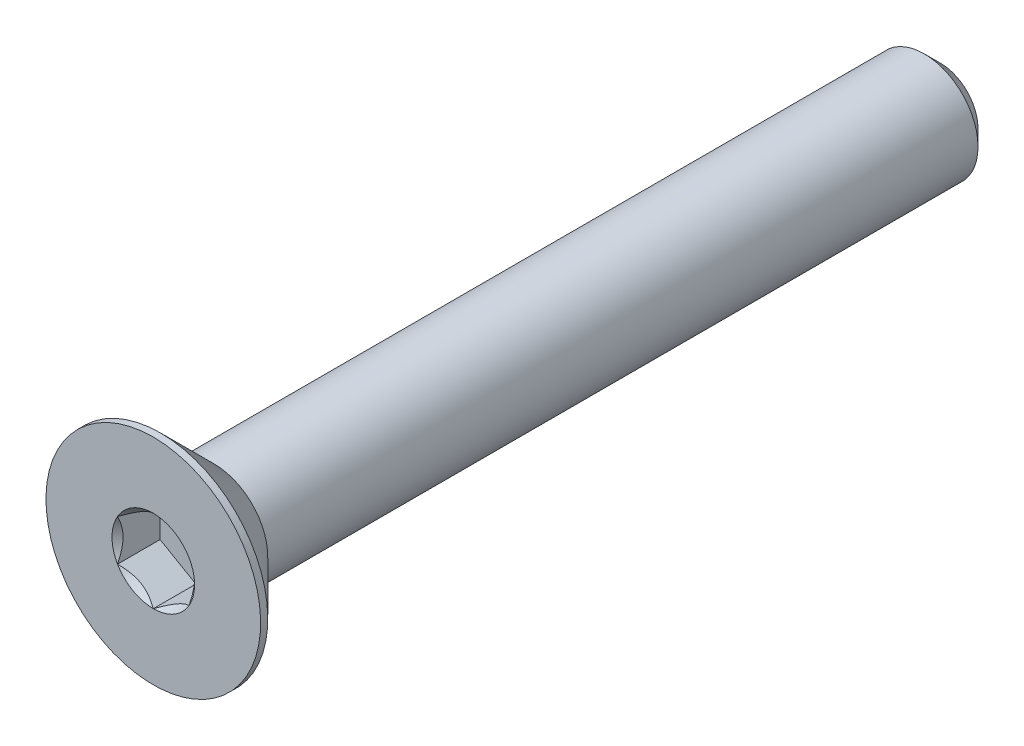
ISO-10303-21;
HEADER;
FILE_DESCRIPTION(('STEP AP214'),'2;1');
FILE_NAME('part.step','',(''),(''),'','','');
FILE_SCHEMA(('AUTOMOTIVE_DESIGN { 1 0 10303 214 1 1 1 1 }'));
ENDSEC;
DATA;
#1=APPLICATION_CONTEXT('core data for automotive mechanical design processes');
#2=APPLICATION_PROTOCOL_DEFINITION('international standard','automotive_design',2000,#1);
#3=PRODUCT_CONTEXT('',#1,'mechanical');
#4=PRODUCT('Part','Part','',(#3));
#5=PRODUCT_RELATED_PRODUCT_CATEGORY('part','',(#4));
#6=PRODUCT_DEFINITION_FORMATION('','',#4);
#7=PRODUCT_DEFINITION_CONTEXT('part definition',#1,'design');
#8=PRODUCT_DEFINITION('design','',#6,#7);
#9=PRODUCT_DEFINITION_SHAPE('','',#8);
#10=(LENGTH_UNIT() NAMED_UNIT(*) SI_UNIT(.MILLI.,.METRE.));
#11=(NAMED_UNIT(*) PLANE_ANGLE_UNIT() SI_UNIT($,.RADIAN.));
#12=(NAMED_UNIT(*) SI_UNIT($,.STERADIAN.) SOLID_ANGLE_UNIT());
#13=UNCERTAINTY_MEASURE_WITH_UNIT(LENGTH_MEASURE(1.E-05),#10,'distance_accuracy_value','');
#14=(GEOMETRIC_REPRESENTATION_CONTEXT(3) GLOBAL_UNCERTAINTY_ASSIGNED_CONTEXT((#13)) GLOBAL_UNIT_ASSIGNED_CONTEXT((#10,
#11,#12)) REPRESENTATION_CONTEXT('',''));
#15=CARTESIAN_POINT('',(0.,0.,0.));
#16=DIRECTION('',(0.,0.,1.));
#17=DIRECTION('',(1.,0.,0.));
#18=AXIS2_PLACEMENT_3D('',#15,#16,#17);
#19=CARTESIAN_POINT('',(0.,0.,-11.));
#20=DIRECTION('',(0.,0.,-1.));
#21=DIRECTION('',(0.,1.,0.));
#22=AXIS2_PLACEMENT_3D('',#19,#20,#21);
#23=CYLINDRICAL_SURFACE('',#22,1.5);
#24=CARTESIAN_POINT('',(0.,0.,9.3));
#25=DIRECTION('',(0.,0.,-1.));
#26=DIRECTION('',(0.,1.,0.));
#27=AXIS2_PLACEMENT_3D('',#24,#25,#26);
#28=CIRCLE('',#27,1.5);
#29=CARTESIAN_POINT('',(0.,1.5,9.3));
#30=VERTEX_POINT('',#29);
#31=EDGE_CURVE('E11',#30,#30,#28,.F.);
#32=ORIENTED_EDGE('',*,*,#31,.F.);
#33=EDGE_LOOP('',(#32));
#34=FACE_BOUND('',#33,.T.);
#35=CARTESIAN_POINT('',(0.,0.,-10.55));
#36=DIRECTION('',(0.,0.,-1.));
#37=DIRECTION('',(0.,1.,0.));
#38=AXIS2_PLACEMENT_3D('',#35,#36,#37);
#39=CIRCLE('',#38,1.5);
#40=CARTESIAN_POINT('',(0.,-1.5,-10.55));
#41=VERTEX_POINT('',#40);
#42=EDGE_CURVE('E47',#41,#41,#39,.F.);
#43=ORIENTED_EDGE('',*,*,#42,.T.);
#44=EDGE_LOOP('',(#43));
#45=FACE_BOUND('',#44,.T.);
#46=ADVANCED_FACE('F39',(#34,#45),#23,.T.);
#47=CARTESIAN_POINT('',(0.,1.5,-11.));
#48=DIRECTION('',(0.,0.,-1.));
#49=DIRECTION('',(0.,1.,0.));
#50=AXIS2_PLACEMENT_3D('',#47,#48,#49);
#51=PLANE('',#50);
#52=CARTESIAN_POINT('',(0.,0.,-11.));
#53=DIRECTION('',(0.,0.,-1.));
#54=DIRECTION('',(0.,1.,0.));
#55=AXIS2_PLACEMENT_3D('',#52,#53,#54);
#56=CIRCLE('',#55,1.04999999999999);
#57=CARTESIAN_POINT('',(0.,-1.04999999999999,-11.));
#58=VERTEX_POINT('',#57);
#59=EDGE_CURVE('E151',#58,#58,#56,.T.);
#60=ORIENTED_EDGE('',*,*,#59,.T.);
#61=EDGE_LOOP('',(#60));
#62=FACE_BOUND('',#61,.T.);
#63=ADVANCED_FACE('F160',(#62),#51,.T.);
#64=CARTESIAN_POINT('',(0.,0.,-11.));
#65=DIRECTION('',(0.,0.,1.));
#66=DIRECTION('',(0.,-1.,0.));
#67=AXIS2_PLACEMENT_3D('',#64,#65,#66);
#68=CONICAL_SURFACE('',#67,1.04999999999999,0.78539816339745);
#69=CARTESIAN_POINT('',(0.,-1.5,-10.55));
#70=CARTESIAN_POINT('',(0.,-1.4953125,-10.5546875));
#71=CARTESIAN_POINT('',(0.,-1.490625,-10.559375));
#72=CARTESIAN_POINT('',(0.,-1.48125,-10.56875));
#73=CARTESIAN_POINT('',(0.,-1.4765625,-10.5734375));
#74=CARTESIAN_POINT('',(0.,-1.4671875,-10.5828125));
#75=CARTESIAN_POINT('',(0.,-1.4625,-10.5875));
#76=CARTESIAN_POINT('',(0.,-1.453125,-10.596875));
#77=CARTESIAN_POINT('',(0.,-1.4484375,-10.6015625));
#78=CARTESIAN_POINT('',(0.,-1.4390625,-10.6109375));
#79=CARTESIAN_POINT('',(0.,-1.434375,-10.615625));
#80=CARTESIAN_POINT('',(0.,-1.425,-10.625));
#81=CARTESIAN_POINT('',(0.,-1.4203125,-10.6296875));
#82=CARTESIAN_POINT('',(0.,-1.4109375,-10.6390625));
#83=CARTESIAN_POINT('',(0.,-1.40625,-10.64375));
#84=CARTESIAN_POINT('',(0.,-1.396875,-10.653125));
#85=CARTESIAN_POINT('',(0.,-1.3921875,-10.6578125));
#86=CARTESIAN_POINT('',(0.,-1.38281249999999,-10.6671875));
#87=CARTESIAN_POINT('',(0.,-1.37812499999999,-10.671875));
#88=CARTESIAN_POINT('',(0.,-1.36874999999999,-10.68125));
#89=CARTESIAN_POINT('',(0.,-1.36406249999999,-10.6859375));
#90=CARTESIAN_POINT('',(0.,-1.35468749999999,-10.6953125));
#91=CARTESIAN_POINT('',(0.,-1.34999999999999,-10.7));
#92=CARTESIAN_POINT('',(0.,-1.34062499999999,-10.709375));
#93=CARTESIAN_POINT('',(0.,-1.33593749999999,-10.7140625));
#94=CARTESIAN_POINT('',(0.,-1.32656249999999,-10.7234375));
#95=CARTESIAN_POINT('',(0.,-1.32187499999999,-10.728125));
#96=CARTESIAN_POINT('',(0.,-1.31249999999999,-10.7375));
#97=CARTESIAN_POINT('',(0.,-1.30781249999999,-10.7421875));
#98=CARTESIAN_POINT('',(0.,-1.29843749999999,-10.7515625));
#99=CARTESIAN_POINT('',(0.,-1.29374999999999,-10.75625));
#100=CARTESIAN_POINT('',(0.,-1.28437499999999,-10.765625));
#101=CARTESIAN_POINT('',(0.,-1.27968749999999,-10.7703125));
#102=CARTESIAN_POINT('',(0.,-1.27031249999999,-10.7796875));
#103=CARTESIAN_POINT('',(0.,-1.26562499999999,-10.784375));
#104=CARTESIAN_POINT('',(0.,-1.25624999999999,-10.79375));
#105=CARTESIAN_POINT('',(0.,-1.25156249999999,-10.7984375));
#106=CARTESIAN_POINT('',(0.,-1.24218749999999,-10.8078125));
#107=CARTESIAN_POINT('',(0.,-1.23749999999999,-10.8125));
#108=CARTESIAN_POINT('',(0.,-1.22812499999999,-10.821875));
#109=CARTESIAN_POINT('',(0.,-1.22343749999999,-10.8265625));
#110=CARTESIAN_POINT('',(0.,-1.21406249999999,-10.8359375));
#111=CARTESIAN_POINT('',(0.,-1.20937499999999,-10.840625));
#112=CARTESIAN_POINT('',(0.,-1.19999999999999,-10.85));
#113=CARTESIAN_POINT('',(0.,-1.19531249999999,-10.8546875));
#114=CARTESIAN_POINT('',(0.,-1.18593749999999,-10.8640625));
#115=CARTESIAN_POINT('',(0.,-1.18124999999999,-10.86875));
#116=CARTESIAN_POINT('',(0.,-1.17187499999999,-10.878125));
#117=CARTESIAN_POINT('',(0.,-1.16718749999999,-10.8828125));
#118=CARTESIAN_POINT('',(0.,-1.15781249999999,-10.8921875));
#119=CARTESIAN_POINT('',(0.,-1.15312499999999,-10.896875));
#120=CARTESIAN_POINT('',(0.,-1.14374999999999,-10.90625));
#121=CARTESIAN_POINT('',(0.,-1.13906249999999,-10.9109375));
#122=CARTESIAN_POINT('',(0.,-1.12968749999999,-10.9203125));
#123=CARTESIAN_POINT('',(0.,-1.12499999999999,-10.925));
#124=CARTESIAN_POINT('',(0.,-1.11562499999999,-10.934375));
#125=CARTESIAN_POINT('',(0.,-1.11093749999999,-10.9390625));
#126=CARTESIAN_POINT('',(0.,-1.10156249999999,-10.9484375));
#127=CARTESIAN_POINT('',(0.,-1.09687499999999,-10.953125));
#128=CARTESIAN_POINT('',(0.,-1.08749999999999,-10.9625));
#129=CARTESIAN_POINT('',(0.,-1.08281249999999,-10.9671875));
#130=CARTESIAN_POINT('',(0.,-1.07343749999999,-10.9765625));
#131=CARTESIAN_POINT('',(0.,-1.06874999999999,-10.98125));
#132=CARTESIAN_POINT('',(0.,-1.05937499999999,-10.990625));
#133=CARTESIAN_POINT('',(0.,-1.05468749999999,-10.9953125));
#134=CARTESIAN_POINT('',(0.,-1.04999999999999,-11.));
#135=B_SPLINE_CURVE_WITH_KNOTS('',3,(#69,#70,#71,#72,#73,#74,#75,#76,#77,#78,#79,#80,#81,#82,
#83,#84,#85,#86,#87,#88,#89,#90,#91,#92,#93,#94,#95,#96,#97,#98,#99,#100,#101,#102,#103,#104,
#105,#106,#107,#108,#109,#110,#111,#112,#113,#114,#115,#116,#117,#118,#119,#120,#121,#122,#123,
#124,#125,#126,#127,#128,#129,#130,#131,#132,#133,#134),.UNSPECIFIED.,.F.,.F.,(4,2,2,2,2,2,2,2,
2,2,2,2,2,2,2,2,2,2,2,2,2,2,2,2,2,2,2,2,2,2,2,2,4),(0.,0.0198873782208719,0.0397747564417438,
0.0596621346626157,0.0795495128834878,0.0994368911043597,0.119324269325232,0.139211647546104,
0.159099025766976,0.178986403987848,0.198873782208719,0.218761160429591,0.238648538650463,
0.258535916871335,0.278423295092207,0.298310673313079,0.318198051533951,0.338085429754823,
0.357972807975695,0.377860186196567,0.397747564417439,0.417634942638311,0.437522320859183,
0.457409699080054,0.477297077300926,0.497184455521798,0.51707183374267,0.536959211963542,
0.556846590184414,0.576733968405286,0.596621346626158,0.61650872484703,0.636396103067901),.UNSPECIFIED.);
#136=EDGE_CURVE('BSEAM41',#41,#58,#135,.T.);
#137=ORIENTED_EDGE('',*,*,#42,.F.);
#138=ORIENTED_EDGE('',*,*,#59,.F.);
#139=ORIENTED_EDGE('',*,*,#136,.T.);
#140=ORIENTED_EDGE('',*,*,#136,.F.);
#141=EDGE_LOOP('',(#137,#139,#138,#140));
#142=FACE_BOUND('',#141,.T.);
#143=ADVANCED_FACE('F41',(#142),#68,.T.);
#144=CARTESIAN_POINT('',(0.,0.,-11.));
#145=DIRECTION('',(0.,0.,-1.));
#146=DIRECTION('',(0.,1.,0.));
#147=AXIS2_PLACEMENT_3D('',#144,#145,#146);
#148=CYLINDRICAL_SURFACE('',#147,3.);
#149=CARTESIAN_POINT('',(0.,0.,11.));
#150=DIRECTION('',(0.,0.,-1.));
#151=DIRECTION('',(0.,1.,0.));
#152=AXIS2_PLACEMENT_3D('',#149,#150,#151);
#153=CIRCLE('',#152,3.);
#154=CARTESIAN_POINT('',(0.,3.,11.));
#155=VERTEX_POINT('',#154);
#156=EDGE_CURVE('E131',#155,#155,#153,.T.);
#157=ORIENTED_EDGE('',*,*,#156,.T.);
#158=EDGE_LOOP('',(#157));
#159=FACE_BOUND('',#158,.T.);
#160=CARTESIAN_POINT('',(0.,0.,10.8));
#161=DIRECTION('',(0.,0.,-1.));
#162=DIRECTION('',(0.,1.,0.));
#163=AXIS2_PLACEMENT_3D('',#160,#161,#162);
#164=CIRCLE('',#163,3.);
#165=CARTESIAN_POINT('',(0.,3.,10.8));
#166=VERTEX_POINT('',#165);
#167=EDGE_CURVE('E128',#166,#166,#164,.T.);
#168=ORIENTED_EDGE('',*,*,#167,.F.);
#169=EDGE_LOOP('',(#168));
#170=FACE_BOUND('',#169,.T.);
#171=ADVANCED_FACE('F159',(#159,#170),#148,.T.);
#172=CARTESIAN_POINT('',(0.,0.,9.3));
#173=DIRECTION('',(0.,0.,1.));
#174=DIRECTION('',(0.,-1.,0.));
#175=AXIS2_PLACEMENT_3D('',#172,#173,#174);
#176=CONICAL_SURFACE('',#175,1.5,0.78539816339745);
#177=ORIENTED_EDGE('',*,*,#167,.T.);
#178=EDGE_LOOP('',(#177));
#179=FACE_BOUND('',#178,.T.);
#180=ORIENTED_EDGE('',*,*,#31,.T.);
#181=EDGE_LOOP('',(#180));
#182=FACE_BOUND('',#181,.T.);
#183=ADVANCED_FACE('F173',(#179,#182),#176,.T.);
#184=CARTESIAN_POINT('',(0.,0.,11.));
#185=DIRECTION('',(0.,0.,1.));
#186=DIRECTION('',(0.,-1.,0.));
#187=AXIS2_PLACEMENT_3D('',#184,#185,#186);
#188=PLANE('',#187);
#189=CARTESIAN_POINT('',(0.,0.,11.));
#190=DIRECTION('',(0.,0.,1.));
#191=DIRECTION('',(1.,0.,0.));
#192=AXIS2_PLACEMENT_3D('',#189,#190,#191);
#193=CIRCLE('',#192,1.15470053837925);
#194=CARTESIAN_POINT('',(1.,0.57735026918963,11.));
#195=VERTEX_POINT('',#194);
#196=CARTESIAN_POINT('',(0.,1.15470053837926,11.));
#197=VERTEX_POINT('',#196);
#198=EDGE_CURVE('E98',#195,#197,#193,.T.);
#199=ORIENTED_EDGE('',*,*,#198,.F.);
#200=CARTESIAN_POINT('',(0.,0.,11.));
#201=DIRECTION('',(0.,0.,1.));
#202=DIRECTION('',(1.,0.,0.));
#203=AXIS2_PLACEMENT_3D('',#200,#201,#202);
#204=CIRCLE('',#203,1.15470053837925);
#205=CARTESIAN_POINT('',(0.999999999999989,-0.577350269189633,11.));
#206=VERTEX_POINT('',#205);
#207=EDGE_CURVE('E110',#206,#195,#204,.T.);
#208=ORIENTED_EDGE('',*,*,#207,.F.);
#209=CARTESIAN_POINT('',(0.,0.,11.));
#210=DIRECTION('',(0.,0.,1.));
#211=DIRECTION('',(1.,0.,0.));
#212=AXIS2_PLACEMENT_3D('',#209,#210,#211);
#213=CIRCLE('',#212,1.15470053837925);
#214=CARTESIAN_POINT('',(0.,-1.15470053837924,11.));
#215=VERTEX_POINT('',#214);
#216=EDGE_CURVE('E244',#215,#206,#213,.T.);
#217=ORIENTED_EDGE('',*,*,#216,.F.);
#218=CARTESIAN_POINT('',(0.,0.,11.));
#219=DIRECTION('',(0.,0.,1.));
#220=DIRECTION('',(1.,0.,0.));
#221=AXIS2_PLACEMENT_3D('',#218,#219,#220);
#222=CIRCLE('',#221,1.15470053837925);
#223=CARTESIAN_POINT('',(-1.,-0.577350269189614,11.));
#224=VERTEX_POINT('',#223);
#225=EDGE_CURVE('E123',#224,#215,#222,.T.);
#226=ORIENTED_EDGE('',*,*,#225,.F.);
#227=CARTESIAN_POINT('',(0.,0.,11.));
#228=DIRECTION('',(0.,0.,1.));
#229=DIRECTION('',(1.,0.,0.));
#230=AXIS2_PLACEMENT_3D('',#227,#228,#229);
#231=CIRCLE('',#230,1.15470053837925);
#232=CARTESIAN_POINT('',(-1.,0.577350269189625,11.));
#233=VERTEX_POINT('',#232);
#234=EDGE_CURVE('E245',#233,#224,#231,.T.);
#235=ORIENTED_EDGE('',*,*,#234,.F.);
#236=CARTESIAN_POINT('',(0.,0.,11.));
#237=DIRECTION('',(0.,0.,1.));
#238=DIRECTION('',(1.,0.,0.));
#239=AXIS2_PLACEMENT_3D('',#236,#237,#238);
#240=CIRCLE('',#239,1.15470053837925);
#241=EDGE_CURVE('E113',#197,#233,#240,.T.);
#242=ORIENTED_EDGE('',*,*,#241,.F.);
#243=EDGE_LOOP('',(#199,#208,#217,#226,#235,#242));
#244=FACE_BOUND('',#243,.T.);
#245=ORIENTED_EDGE('',*,*,#156,.F.);
#246=EDGE_LOOP('',(#245));
#247=FACE_BOUND('',#246,.T.);
#248=ADVANCED_FACE('F107',(#244,#247),#188,.T.);
#249=CARTESIAN_POINT('',(1.,0.577350269189626,9.81));
#250=DIRECTION('',(0.5,0.866025403784438,0.));
#251=DIRECTION('',(-0.866025403784439,0.5,0.));
#252=AXIS2_PLACEMENT_3D('',#249,#250,#251);
#253=PLANE('',#252);
#254=DIRECTION('',(0.,0.,1.));
#255=VECTOR('',#254,1.);
#256=CARTESIAN_POINT('',(1.,0.577350269189626,9.81));
#257=LINE('',#256,#255);
#258=CARTESIAN_POINT('',(1.,0.577350269189626,9.81));
#259=VERTEX_POINT('',#258);
#260=EDGE_CURVE('E54',#259,#195,#257,.T.);
#261=ORIENTED_EDGE('',*,*,#260,.T.);
#262=CARTESIAN_POINT('',(-0.000199999999999771,1.15481600843309,11.0001154873726));
#263=CARTESIAN_POINT('',(0.0341825950071803,1.13496520795026,10.9802779308257));
#264=CARTESIAN_POINT('',(0.0691401181398242,1.11478247255942,10.9616050206389));
#265=CARTESIAN_POINT('',(0.140422802956089,1.07362739529219,10.9274147427232));
#266=CARTESIAN_POINT('',(0.176754750528983,1.0526511355808,10.9119164090235));
#267=CARTESIAN_POINT('',(0.25001661380331,1.01035337909803,10.8853673071423));
#268=CARTESIAN_POINT('',(0.286927851445413,0.989042666109242,10.8742497739969));
#269=CARTESIAN_POINT('',(0.361562729310857,0.945952199282693,10.8571198657762));
#270=CARTESIAN_POINT('',(0.399284088108634,0.924173762626598,10.8510946974667));
#271=CARTESIAN_POINT('',(0.464292198417931,0.886641312640016,10.8456605549675));
#272=CARTESIAN_POINT('',(0.491494371528169,0.870936130672278,10.8448569383167));
#273=CARTESIAN_POINT('',(0.545846040669109,0.839556179862851,10.8462066994169));
#274=CARTESIAN_POINT('',(0.572995523754873,0.823881418494926,10.8483607295472));
#275=CARTESIAN_POINT('',(0.654056277326957,0.777080970599369,10.8591169721285));
#276=CARTESIAN_POINT('',(0.707564140978423,0.746188191116433,10.8720145564154));
#277=CARTESIAN_POINT('',(0.801476065143428,0.691968116419652,10.9031407306022));
#278=CARTESIAN_POINT('',(0.842320523671832,0.668386557293374,10.9197377977018));
#279=CARTESIAN_POINT('',(0.922409637381942,0.622147085933683,10.9571249246853));
#280=CARTESIAN_POINT('',(0.961659010870437,0.599486449584576,10.9779013418174));
#281=CARTESIAN_POINT('',(1.0002,0.577234799135788,11.0001154873726));
#282=B_SPLINE_CURVE_WITH_KNOTS('',3,(#262,#263,#264,#265,#266,#267,#268,#269,#270,#271,#272,
#273,#274,#275,#276,#277,#278,#279,#280,#281),.UNSPECIFIED.,.F.,.F.,(4,2,2,2,2,2,2,2,2,4),(0.,
0.133237676828559,0.267252229834489,0.399137076269299,0.530689603280766,0.624814864263843,
0.718960890149129,0.907306626112093,1.05710100361789,1.20641411519286),.UNSPECIFIED.);
#283=EDGE_CURVE('E95',#197,#195,#282,.T.);
#284=ORIENTED_EDGE('',*,*,#283,.F.);
#285=DIRECTION('',(0.,0.,1.));
#286=VECTOR('',#285,1.);
#287=CARTESIAN_POINT('',(0.,1.15470053837925,9.81));
#288=LINE('',#287,#286);
#289=CARTESIAN_POINT('',(0.,1.15470053837925,9.81));
#290=VERTEX_POINT('',#289);
#291=EDGE_CURVE('E147',#290,#197,#288,.T.);
#292=ORIENTED_EDGE('',*,*,#291,.F.);
#293=DIRECTION('',(-0.866025403784439,0.5,0.));
#294=VECTOR('',#293,1.);
#295=CARTESIAN_POINT('',(1.,0.577350269189626,9.81));
#296=LINE('',#295,#294);
#297=EDGE_CURVE('E120',#259,#290,#296,.T.);
#298=ORIENTED_EDGE('',*,*,#297,.F.);
#299=EDGE_LOOP('',(#261,#284,#292,#298));
#300=FACE_BOUND('',#299,.T.);
#301=ADVANCED_FACE('F125',(#300),#253,.F.);
#302=CARTESIAN_POINT('',(1.,-0.577350269189627,9.81));
#303=DIRECTION('',(1.,0.,0.));
#304=DIRECTION('',(0.,0.,-1.));
#305=AXIS2_PLACEMENT_3D('',#302,#303,#304);
#306=PLANE('',#305);
#307=DIRECTION('',(0.,0.,1.));
#308=VECTOR('',#307,1.);
#309=CARTESIAN_POINT('',(1.,-0.577350269189627,9.81));
#310=LINE('',#309,#308);
#311=CARTESIAN_POINT('',(1.,-0.577350269189627,9.81));
#312=VERTEX_POINT('',#311);
#313=EDGE_CURVE('E62',#312,#206,#310,.T.);
#314=ORIENTED_EDGE('',*,*,#313,.T.);
#315=CARTESIAN_POINT('',(1.,-1.15147208646462,11.3703856775139));
#316=CARTESIAN_POINT('',(1.,-1.12343447988553,11.3492199198737));
#317=CARTESIAN_POINT('',(1.,-1.09524064850698,11.3282616921759));
#318=CARTESIAN_POINT('',(1.,-1.03847715644377,11.2868460222356));
#319=CARTESIAN_POINT('',(1.,-1.00990740382976,11.2663887061237));
#320=CARTESIAN_POINT('',(1.,-0.923120894333482,11.2056047949545));
#321=CARTESIAN_POINT('',(1.,-0.864253173759064,11.1661922289614));
#322=CARTESIAN_POINT('',(1.,-0.740809858258048,11.0888206642002));
#323=CARTESIAN_POINT('',(1.,-0.676100255137809,11.0510730391143));
#324=CARTESIAN_POINT('',(1.,-0.543448939049125,10.9820245875513));
#325=CARTESIAN_POINT('',(1.,-0.475519112027779,10.9507020278469));
#326=CARTESIAN_POINT('',(1.,-0.373555850333528,10.9123817788838));
#327=CARTESIAN_POINT('',(1.,-0.341031989670907,10.9013835916422));
#328=CARTESIAN_POINT('',(1.,-0.275199079052291,10.8819983421474));
#329=CARTESIAN_POINT('',(1.,-0.241889975173931,10.8736114597767));
#330=CARTESIAN_POINT('',(1.,-0.17524751704299,10.860025220719));
#331=CARTESIAN_POINT('',(1.,-0.141925568218172,10.854770790768));
#332=CARTESIAN_POINT('',(1.,-0.0749144362322753,10.8475486865709));
#333=CARTESIAN_POINT('',(1.,-0.0412251978501577,10.8455815136105));
#334=CARTESIAN_POINT('',(1.,0.0249580992634258,10.8450831983932));
#335=CARTESIAN_POINT('',(1.,0.0574512826460443,10.8464302678886));
#336=CARTESIAN_POINT('',(1.,0.122148505701872,10.852216484499));
#337=CARTESIAN_POINT('',(1.,0.154352610132932,10.8566549206615));
#338=CARTESIAN_POINT('',(1.,0.218799898867646,10.8684568301452));
#339=CARTESIAN_POINT('',(1.,0.25103374326896,10.8758705410385));
#340=CARTESIAN_POINT('',(1.,0.314797132354925,10.8932289424987));
#341=CARTESIAN_POINT('',(1.,0.346326735731011,10.9031734212888));
#342=CARTESIAN_POINT('',(1.,0.445594187730211,10.9382234825543));
#343=CARTESIAN_POINT('',(1.,0.511919139476042,10.9673208583567));
#344=CARTESIAN_POINT('',(1.,0.641453244657537,11.0320153296865));
#345=CARTESIAN_POINT('',(1.,0.704650133126349,11.0676357767152));
#346=CARTESIAN_POINT('',(1.,0.825428490174991,11.1411239013469));
#347=CARTESIAN_POINT('',(1.,0.883132947867689,11.1787919471355));
#348=CARTESIAN_POINT('',(1.,0.968148853704569,11.2370228529432));
#349=CARTESIAN_POINT('',(1.,0.996120570380289,11.2566384757629));
#350=CARTESIAN_POINT('',(1.,1.05168177729902,11.2963885170613));
#351=CARTESIAN_POINT('',(1.,1.07927136997701,11.3165227921988));
#352=CARTESIAN_POINT('',(1.,1.1067018534633,11.336872119073));
#353=B_SPLINE_CURVE_WITH_KNOTS('',3,(#315,#316,#317,#318,#319,#320,#321,#322,#323,#324,#325,
#326,#327,#328,#329,#330,#331,#332,#333,#334,#335,#336,#337,#338,#339,#340,#341,#342,#343,#344,
#345,#346,#347,#348,#349,#350,#351,#352),.UNSPECIFIED.,.F.,.F.,(4,2,2,2,2,2,2,2,2,2,2,2,2,2,2,2,
2,2,4),(0.,0.105386459083291,0.210799187330127,0.423233611565474,0.647793540908512,
0.871580877738621,0.974493074181433,1.07741235827203,1.17846428203206,1.27953161415764,
1.37694086739612,1.47432772585409,1.57343322804295,1.67253043972853,1.88917353996829,
2.10660791038814,2.31323734249845,2.41572589232046,2.51818641476505),.UNSPECIFIED.);
#354=EDGE_CURVE('E119',#195,#206,#353,.F.);
#355=ORIENTED_EDGE('',*,*,#354,.F.);
#356=ORIENTED_EDGE('',*,*,#260,.F.);
#357=DIRECTION('',(0.,1.,0.));
#358=VECTOR('',#357,1.);
#359=CARTESIAN_POINT('',(1.,-0.577350269189627,9.81));
#360=LINE('',#359,#358);
#361=EDGE_CURVE('E136',#312,#259,#360,.T.);
#362=ORIENTED_EDGE('',*,*,#361,.F.);
#363=EDGE_LOOP('',(#314,#355,#356,#362));
#364=FACE_BOUND('',#363,.T.);
#365=ADVANCED_FACE('F122',(#364),#306,.F.);
#366=CARTESIAN_POINT('',(0.,-1.15470053837925,9.81));
#367=DIRECTION('',(0.5,-0.866025403784439,0.));
#368=DIRECTION('',(0.866025403784439,0.5,0.));
#369=AXIS2_PLACEMENT_3D('',#366,#367,#368);
#370=PLANE('',#369);
#371=DIRECTION('',(0.,0.,1.));
#372=VECTOR('',#371,1.);
#373=CARTESIAN_POINT('',(0.,-1.15470053837925,9.81));
#374=LINE('',#373,#372);
#375=CARTESIAN_POINT('',(0.,-1.15470053837925,9.81));
#376=VERTEX_POINT('',#375);
#377=EDGE_CURVE('E133',#376,#215,#374,.T.);
#378=ORIENTED_EDGE('',*,*,#377,.T.);
#379=CARTESIAN_POINT('',(1.0002,-0.577234799135789,11.0001154873726));
#380=CARTESIAN_POINT('',(0.965817404992819,-0.597085599618622,10.9802779308257));
#381=CARTESIAN_POINT('',(0.930859881860175,-0.617268335009457,10.9616050206389));
#382=CARTESIAN_POINT('',(0.859577197043911,-0.658423412276686,10.9274147427232));
#383=CARTESIAN_POINT('',(0.823245249471016,-0.67939967198808,10.9119164090235));
#384=CARTESIAN_POINT('',(0.74998338619669,-0.721697428470846,10.8853673071423));
#385=CARTESIAN_POINT('',(0.713072148554587,-0.743008141459636,10.8742497739969));
#386=CARTESIAN_POINT('',(0.638437270689143,-0.786098608286185,10.8571198657762));
#387=CARTESIAN_POINT('',(0.600715911891367,-0.80787704494228,10.8510946974667));
#388=CARTESIAN_POINT('',(0.535707801582069,-0.845409494928862,10.8456605549675));
#389=CARTESIAN_POINT('',(0.50850562847183,-0.861114676896601,10.8448569383167));
#390=CARTESIAN_POINT('',(0.45415395933089,-0.892494627706028,10.8462066994169));
#391=CARTESIAN_POINT('',(0.427004476245126,-0.908169389073953,10.8483607295472));
#392=CARTESIAN_POINT('',(0.345943722673041,-0.95496983696951,10.8591169721285));
#393=CARTESIAN_POINT('',(0.292435859021574,-0.985862616452447,10.8720145564154));
#394=CARTESIAN_POINT('',(0.198523934856569,-1.04008269114923,10.9031407306022));
#395=CARTESIAN_POINT('',(0.157679476328166,-1.06366425027551,10.9197377977018));
#396=CARTESIAN_POINT('',(0.0775903626180562,-1.1099037216352,10.9571249246853));
#397=CARTESIAN_POINT('',(0.0383409891295624,-1.1325643579843,10.9779013418174));
#398=CARTESIAN_POINT('',(-0.000199999999999769,-1.15481600843309,11.0001154873726));
#399=B_SPLINE_CURVE_WITH_KNOTS('',3,(#379,#380,#381,#382,#383,#384,#385,#386,#387,#388,#389,
#390,#391,#392,#393,#394,#395,#396,#397,#398),.UNSPECIFIED.,.F.,.F.,(4,2,2,2,2,2,2,2,2,4),(0.,
0.133237676828559,0.267252229834488,0.399137076269297,0.530689603280764,0.624814864263842,
0.71896089014913,0.907306626112095,1.05710100361789,1.20641411519286),.UNSPECIFIED.);
#400=EDGE_CURVE('E242',#206,#215,#399,.T.);
#401=ORIENTED_EDGE('',*,*,#400,.F.);
#402=ORIENTED_EDGE('',*,*,#313,.F.);
#403=DIRECTION('',(0.866025403784439,0.5,0.));
#404=VECTOR('',#403,1.);
#405=CARTESIAN_POINT('',(0.,-1.15470053837925,9.81));
#406=LINE('',#405,#404);
#407=EDGE_CURVE('E234',#376,#312,#406,.T.);
#408=ORIENTED_EDGE('',*,*,#407,.F.);
#409=EDGE_LOOP('',(#378,#401,#402,#408));
#410=FACE_BOUND('',#409,.T.);
#411=ADVANCED_FACE('F199',(#410),#370,.F.);
#412=CARTESIAN_POINT('',(-1.,-0.577350269189626,9.81));
#413=DIRECTION('',(-0.5,-0.866025403784439,0.));
#414=DIRECTION('',(0.866025403784439,-0.5,0.));
#415=AXIS2_PLACEMENT_3D('',#412,#413,#414);
#416=PLANE('',#415);
#417=DIRECTION('',(0.,0.,1.));
#418=VECTOR('',#417,1.);
#419=CARTESIAN_POINT('',(-1.,-0.577350269189626,9.81));
#420=LINE('',#419,#418);
#421=CARTESIAN_POINT('',(-1.,-0.577350269189626,9.81));
#422=VERTEX_POINT('',#421);
#423=EDGE_CURVE('E141',#422,#224,#420,.T.);
#424=ORIENTED_EDGE('',*,*,#423,.T.);
#425=CARTESIAN_POINT('',(0.000199999999999587,-1.15481600843309,11.0001154873726));
#426=CARTESIAN_POINT('',(-0.0341825950071814,-1.13496520795026,10.9802779308257));
#427=CARTESIAN_POINT('',(-0.0691401181398257,-1.11478247255942,10.9616050206389));
#428=CARTESIAN_POINT('',(-0.140422802956091,-1.07362739529219,10.9274147427232));
#429=CARTESIAN_POINT('',(-0.176754750528985,-1.0526511355808,10.9119164090235));
#430=CARTESIAN_POINT('',(-0.250016613803313,-1.01035337909803,10.8853673071423));
#431=CARTESIAN_POINT('',(-0.286927851445417,-0.98904266610924,10.8742497739969));
#432=CARTESIAN_POINT('',(-0.361562729310862,-0.94595219928269,10.8571198657762));
#433=CARTESIAN_POINT('',(-0.399284088108639,-0.924173762626595,10.8510946974667));
#434=CARTESIAN_POINT('',(-0.464292198417937,-0.886641312640013,10.8456605549675));
#435=CARTESIAN_POINT('',(-0.491494371528175,-0.870936130672274,10.8448569383167));
#436=CARTESIAN_POINT('',(-0.545846040669116,-0.839556179862846,10.8462066994169));
#437=CARTESIAN_POINT('',(-0.572995523754879,-0.823881418494921,10.8483607295472));
#438=CARTESIAN_POINT('',(-0.654056277326965,-0.777080970599364,10.8591169721285));
#439=CARTESIAN_POINT('',(-0.707564140978432,-0.746188191116428,10.8720145564154));
#440=CARTESIAN_POINT('',(-0.801476065143436,-0.691968116419647,10.9031407306022));
#441=CARTESIAN_POINT('',(-0.842320523671838,-0.668386557293369,10.9197377977018));
#442=CARTESIAN_POINT('',(-0.922409637381946,-0.62214708593368,10.9571249246853));
#443=CARTESIAN_POINT('',(-0.961659010870439,-0.599486449584575,10.9779013418174));
#444=CARTESIAN_POINT('',(-1.0002,-0.577234799135788,11.0001154873726));
#445=B_SPLINE_CURVE_WITH_KNOTS('',3,(#425,#426,#427,#428,#429,#430,#431,#432,#433,#434,#435,
#436,#437,#438,#439,#440,#441,#442,#443,#444),.UNSPECIFIED.,.F.,.F.,(4,2,2,2,2,2,2,2,2,4),(0.,
0.13323767682856,0.267252229834491,0.399137076269302,0.530689603280771,0.62481486426385,
0.718960890149137,0.907306626112103,1.0571010036179,1.20641411519286),.UNSPECIFIED.);
#446=EDGE_CURVE('E216',#215,#224,#445,.T.);
#447=ORIENTED_EDGE('',*,*,#446,.F.);
#448=ORIENTED_EDGE('',*,*,#377,.F.);
#449=DIRECTION('',(0.866025403784439,-0.5,0.));
#450=VECTOR('',#449,1.);
#451=CARTESIAN_POINT('',(-1.,-0.577350269189626,9.81));
#452=LINE('',#451,#450);
#453=EDGE_CURVE('E232',#422,#376,#452,.T.);
#454=ORIENTED_EDGE('',*,*,#453,.F.);
#455=EDGE_LOOP('',(#424,#447,#448,#454));
#456=FACE_BOUND('',#455,.T.);
#457=ADVANCED_FACE('F195',(#456),#416,.F.);
#458=CARTESIAN_POINT('',(-1.,0.577350269189626,9.81));
#459=DIRECTION('',(-1.,0.,0.));
#460=DIRECTION('',(0.,-1.,0.));
#461=AXIS2_PLACEMENT_3D('',#458,#459,#460);
#462=PLANE('',#461);
#463=DIRECTION('',(0.,0.,1.));
#464=VECTOR('',#463,1.);
#465=CARTESIAN_POINT('',(-1.,0.577350269189626,9.81));
#466=LINE('',#465,#464);
#467=CARTESIAN_POINT('',(-1.,0.577350269189626,9.81));
#468=VERTEX_POINT('',#467);
#469=EDGE_CURVE('E144',#468,#233,#466,.T.);
#470=ORIENTED_EDGE('',*,*,#469,.T.);
#471=CARTESIAN_POINT('',(-1.,-1.15147208646462,11.3703856775139));
#472=CARTESIAN_POINT('',(-1.,-1.12343447988552,11.3492199198737));
#473=CARTESIAN_POINT('',(-1.,-1.09524064850698,11.3282616921759));
#474=CARTESIAN_POINT('',(-1.,-1.03847715644377,11.2868460222356));
#475=CARTESIAN_POINT('',(-1.,-1.00990740382975,11.2663887061237));
#476=CARTESIAN_POINT('',(-1.,-0.923120894333481,11.2056047949545));
#477=CARTESIAN_POINT('',(-1.,-0.864253173759063,11.1661922289614));
#478=CARTESIAN_POINT('',(-1.,-0.740809858258048,11.0888206642002));
#479=CARTESIAN_POINT('',(-1.,-0.676100255137808,11.0510730391143));
#480=CARTESIAN_POINT('',(-1.,-0.543448939049124,10.9820245875513));
#481=CARTESIAN_POINT('',(-1.,-0.475519112027778,10.9507020278469));
#482=CARTESIAN_POINT('',(-1.,-0.373555850333527,10.9123817788838));
#483=CARTESIAN_POINT('',(-1.,-0.341031989670906,10.9013835916422));
#484=CARTESIAN_POINT('',(-1.,-0.275199079052291,10.8819983421474));
#485=CARTESIAN_POINT('',(-1.,-0.24188997517393,10.8736114597767));
#486=CARTESIAN_POINT('',(-1.,-0.175247517042989,10.860025220719));
#487=CARTESIAN_POINT('',(-1.,-0.141925568218171,10.854770790768));
#488=CARTESIAN_POINT('',(-1.,-0.0749144362322743,10.8475486865709));
#489=CARTESIAN_POINT('',(-1.,-0.0412251978501567,10.8455815136105));
#490=CARTESIAN_POINT('',(-1.,0.0249580992634265,10.8450831983932));
#491=CARTESIAN_POINT('',(-1.,0.0574512826460448,10.8464302678886));
#492=CARTESIAN_POINT('',(-1.,0.122148505701872,10.852216484499));
#493=CARTESIAN_POINT('',(-1.,0.154352610132932,10.8566549206615));
#494=CARTESIAN_POINT('',(-1.,0.218799898867646,10.8684568301452));
#495=CARTESIAN_POINT('',(-1.,0.25103374326896,10.8758705410385));
#496=CARTESIAN_POINT('',(-1.,0.314797132354925,10.8932289424987));
#497=CARTESIAN_POINT('',(-1.,0.346326735731011,10.9031734212888));
#498=CARTESIAN_POINT('',(-1.,0.445594187730212,10.9382234825543));
#499=CARTESIAN_POINT('',(-1.,0.511919139476043,10.9673208583567));
#500=CARTESIAN_POINT('',(-1.,0.641453244657539,11.0320153296865));
#501=CARTESIAN_POINT('',(-1.,0.704650133126351,11.0676357767152));
#502=CARTESIAN_POINT('',(-1.,0.825428490174992,11.1411239013469));
#503=CARTESIAN_POINT('',(-1.,0.883132947867691,11.1787919471355));
#504=CARTESIAN_POINT('',(-1.,0.968148853704571,11.2370228529432));
#505=CARTESIAN_POINT('',(-1.,0.996120570380291,11.2566384757629));
#506=CARTESIAN_POINT('',(-1.,1.05168177729902,11.2963885170613));
#507=CARTESIAN_POINT('',(-1.,1.07927136997701,11.3165227921988));
#508=CARTESIAN_POINT('',(-1.,1.1067018534633,11.336872119073));
#509=B_SPLINE_CURVE_WITH_KNOTS('',3,(#471,#472,#473,#474,#475,#476,#477,#478,#479,#480,#481,
#482,#483,#484,#485,#486,#487,#488,#489,#490,#491,#492,#493,#494,#495,#496,#497,#498,#499,#500,
#501,#502,#503,#504,#505,#506,#507,#508),.UNSPECIFIED.,.F.,.F.,(4,2,2,2,2,2,2,2,2,2,2,2,2,2,2,2,
2,2,4),(0.,0.105386459083291,0.210799187330126,0.423233611565473,0.647793540908511,
0.871580877738619,0.974493074181432,1.07741235827202,1.17846428203206,1.27953161415764,
1.37694086739612,1.47432772585409,1.57343322804295,1.67253043972853,1.88917353996829,
2.10660791038814,2.31323734249845,2.41572589232046,2.51818641476505),.UNSPECIFIED.);
#510=EDGE_CURVE('E101',#224,#233,#509,.T.);
#511=ORIENTED_EDGE('',*,*,#510,.F.);
#512=ORIENTED_EDGE('',*,*,#423,.F.);
#513=DIRECTION('',(0.,-1.,0.));
#514=VECTOR('',#513,1.);
#515=CARTESIAN_POINT('',(-1.,0.577350269189626,9.81));
#516=LINE('',#515,#514);
#517=EDGE_CURVE('E229',#468,#422,#516,.T.);
#518=ORIENTED_EDGE('',*,*,#517,.F.);
#519=EDGE_LOOP('',(#470,#511,#512,#518));
#520=FACE_BOUND('',#519,.T.);
#521=ADVANCED_FACE('F191',(#520),#462,.F.);
#522=CARTESIAN_POINT('',(0.,1.15470053837925,9.81));
#523=DIRECTION('',(-0.5,0.866025403784439,0.));
#524=DIRECTION('',(-0.866025403784439,-0.5,0.));
#525=AXIS2_PLACEMENT_3D('',#522,#523,#524);
#526=PLANE('',#525);
#527=ORIENTED_EDGE('',*,*,#291,.T.);
#528=CARTESIAN_POINT('',(-1.0002,0.577234799135788,11.0001154873726));
#529=CARTESIAN_POINT('',(-0.965817404992819,0.597085599618622,10.9802779308257));
#530=CARTESIAN_POINT('',(-0.930859881860175,0.617268335009457,10.9616050206389));
#531=CARTESIAN_POINT('',(-0.85957719704391,0.658423412276687,10.9274147427232));
#532=CARTESIAN_POINT('',(-0.823245249471015,0.679399671988081,10.9119164090235));
#533=CARTESIAN_POINT('',(-0.749983386196687,0.721697428470848,10.8853673071423));
#534=CARTESIAN_POINT('',(-0.713072148554584,0.743008141459638,10.8742497739969));
#535=CARTESIAN_POINT('',(-0.638437270689139,0.786098608286188,10.8571198657762));
#536=CARTESIAN_POINT('',(-0.600715911891362,0.807877044942282,10.8510946974667));
#537=CARTESIAN_POINT('',(-0.535707801582065,0.845409494928864,10.8456605549675));
#538=CARTESIAN_POINT('',(-0.508505628471826,0.861114676896603,10.8448569383167));
#539=CARTESIAN_POINT('',(-0.454153959330887,0.89249462770603,10.8462066994169));
#540=CARTESIAN_POINT('',(-0.427004476245123,0.908169389073955,10.8483607295472));
#541=CARTESIAN_POINT('',(-0.345943722673039,0.954969836969512,10.8591169721285));
#542=CARTESIAN_POINT('',(-0.292435859021572,0.985862616452448,10.8720145564154));
#543=CARTESIAN_POINT('',(-0.198523934856568,1.04008269114923,10.9031407306022));
#544=CARTESIAN_POINT('',(-0.157679476328165,1.06366425027551,10.9197377977018));
#545=CARTESIAN_POINT('',(-0.0775903626180551,1.1099037216352,10.9571249246853));
#546=CARTESIAN_POINT('',(-0.0383409891295611,1.1325643579843,10.9779013418174));
#547=CARTESIAN_POINT('',(0.000200000000000633,1.15481600843309,11.0001154873726));
#548=B_SPLINE_CURVE_WITH_KNOTS('',3,(#528,#529,#530,#531,#532,#533,#534,#535,#536,#537,#538,
#539,#540,#541,#542,#543,#544,#545,#546,#547),.UNSPECIFIED.,.F.,.F.,(4,2,2,2,2,2,2,2,2,4),(0.,
0.13323767682856,0.267252229834493,0.399137076269303,0.530689603280771,0.624814864263849,
0.718960890149135,0.907306626112099,1.0571010036179,1.20641411519286),.UNSPECIFIED.);
#549=EDGE_CURVE('E238',#233,#197,#548,.T.);
#550=ORIENTED_EDGE('',*,*,#549,.F.);
#551=ORIENTED_EDGE('',*,*,#469,.F.);
#552=DIRECTION('',(-0.866025403784439,-0.5,0.));
#553=VECTOR('',#552,1.);
#554=CARTESIAN_POINT('',(0.,1.15470053837925,9.81));
#555=LINE('',#554,#553);
#556=EDGE_CURVE('E226',#290,#468,#555,.T.);
#557=ORIENTED_EDGE('',*,*,#556,.F.);
#558=EDGE_LOOP('',(#527,#550,#551,#557));
#559=FACE_BOUND('',#558,.T.);
#560=ADVANCED_FACE('F187',(#559),#526,.F.);
#561=CARTESIAN_POINT('',(0.,0.,9.81));
#562=DIRECTION('',(0.,0.,1.));
#563=DIRECTION('',(1.,0.,0.));
#564=AXIS2_PLACEMENT_3D('',#561,#562,#563);
#565=PLANE('',#564);
#566=ORIENTED_EDGE('',*,*,#297,.T.);
#567=ORIENTED_EDGE('',*,*,#556,.T.);
#568=ORIENTED_EDGE('',*,*,#517,.T.);
#569=ORIENTED_EDGE('',*,*,#453,.T.);
#570=ORIENTED_EDGE('',*,*,#407,.T.);
#571=ORIENTED_EDGE('',*,*,#361,.T.);
#572=EDGE_LOOP('',(#566,#567,#568,#569,#570,#571));
#573=FACE_BOUND('',#572,.T.);
#574=ADVANCED_FACE('F190',(#573),#565,.T.);
#575=CARTESIAN_POINT('',(0.,0.,11.));
#576=DIRECTION('',(0.,0.,1.));
#577=DIRECTION('',(1.,0.,0.));
#578=AXIS2_PLACEMENT_3D('',#575,#576,#577);
#579=CONICAL_SURFACE('',#578,1.15470053837925,0.78539816339745);
#580=ORIENTED_EDGE('',*,*,#549,.T.);
#581=ORIENTED_EDGE('',*,*,#241,.T.);
#582=EDGE_LOOP('',(#580,#581));
#583=FACE_BOUND('',#582,.T.);
#584=ADVANCED_FACE('F206',(#583),#579,.F.);
#585=CARTESIAN_POINT('',(0.,0.,11.));
#586=DIRECTION('',(0.,0.,1.));
#587=DIRECTION('',(1.,0.,0.));
#588=AXIS2_PLACEMENT_3D('',#585,#586,#587);
#589=CONICAL_SURFACE('',#588,1.15470053837925,0.78539816339745);
#590=ORIENTED_EDGE('',*,*,#446,.T.);
#591=ORIENTED_EDGE('',*,*,#225,.T.);
#592=EDGE_LOOP('',(#590,#591));
#593=FACE_BOUND('',#592,.T.);
#594=ADVANCED_FACE('F208',(#593),#589,.F.);
#595=CARTESIAN_POINT('',(0.,0.,11.));
#596=DIRECTION('',(0.,0.,1.));
#597=DIRECTION('',(1.,0.,0.));
#598=AXIS2_PLACEMENT_3D('',#595,#596,#597);
#599=CONICAL_SURFACE('',#598,1.15470053837925,0.78539816339745);
#600=ORIENTED_EDGE('',*,*,#354,.T.);
#601=ORIENTED_EDGE('',*,*,#207,.T.);
#602=EDGE_LOOP('',(#600,#601));
#603=FACE_BOUND('',#602,.T.);
#604=ADVANCED_FACE('F118',(#603),#599,.F.);
#605=CARTESIAN_POINT('',(0.,0.,11.));
#606=DIRECTION('',(0.,0.,1.));
#607=DIRECTION('',(1.,0.,0.));
#608=AXIS2_PLACEMENT_3D('',#605,#606,#607);
#609=CONICAL_SURFACE('',#608,1.15470053837925,0.78539816339745);
#610=ORIENTED_EDGE('',*,*,#400,.T.);
#611=ORIENTED_EDGE('',*,*,#216,.T.);
#612=EDGE_LOOP('',(#610,#611));
#613=FACE_BOUND('',#612,.T.);
#614=ADVANCED_FACE('F257',(#613),#609,.F.);
#615=CARTESIAN_POINT('',(0.,0.,11.));
#616=DIRECTION('',(0.,0.,1.));
#617=DIRECTION('',(1.,0.,0.));
#618=AXIS2_PLACEMENT_3D('',#615,#616,#617);
#619=CONICAL_SURFACE('',#618,1.15470053837925,0.78539816339745);
#620=ORIENTED_EDGE('',*,*,#510,.T.);
#621=ORIENTED_EDGE('',*,*,#234,.T.);
#622=EDGE_LOOP('',(#620,#621));
#623=FACE_BOUND('',#622,.T.);
#624=ADVANCED_FACE('F262',(#623),#619,.F.);
#625=CARTESIAN_POINT('',(0.,0.,11.));
#626=DIRECTION('',(0.,0.,1.));
#627=DIRECTION('',(1.,0.,0.));
#628=AXIS2_PLACEMENT_3D('',#625,#626,#627);
#629=CONICAL_SURFACE('',#628,1.15470053837925,0.78539816339745);
#630=ORIENTED_EDGE('',*,*,#283,.T.);
#631=ORIENTED_EDGE('',*,*,#198,.T.);
#632=EDGE_LOOP('',(#630,#631));
#633=FACE_BOUND('',#632,.T.);
#634=ADVANCED_FACE('F97',(#633),#629,.F.);
#635=CLOSED_SHELL('',(#46,#63,#143,#171,#183,#248,#301,#365,#411,#457,#521,#560,#574,#584,#594,
#604,#614,#624,#634));
#636=MANIFOLD_SOLID_BREP('B2',#635);
#637=ADVANCED_BREP_SHAPE_REPRESENTATION('',(#18,#636),#14);
#638=SHAPE_DEFINITION_REPRESENTATION(#9,#637);
ENDSEC;
END-ISO-10303-21;
